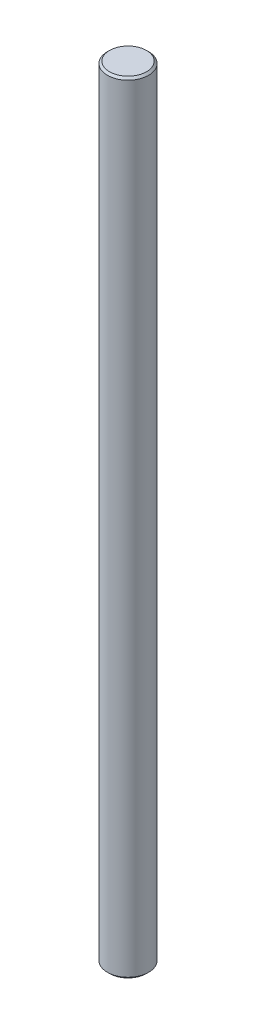
ISO-10303-21;
HEADER;
FILE_DESCRIPTION(('STEP AP214'),'2;1');
FILE_NAME('part.step','',(''),(''),'','','');
FILE_SCHEMA(('AUTOMOTIVE_DESIGN { 1 0 10303 214 1 1 1 1 }'));
ENDSEC;
DATA;
#1=APPLICATION_CONTEXT('core data for automotive mechanical design processes');
#2=APPLICATION_PROTOCOL_DEFINITION('international standard','automotive_design',2000,#1);
#3=PRODUCT_CONTEXT('',#1,'mechanical');
#4=PRODUCT('Part','Part','',(#3));
#5=PRODUCT_RELATED_PRODUCT_CATEGORY('part','',(#4));
#6=PRODUCT_DEFINITION_FORMATION('','',#4);
#7=PRODUCT_DEFINITION_CONTEXT('part definition',#1,'design');
#8=PRODUCT_DEFINITION('design','',#6,#7);
#9=PRODUCT_DEFINITION_SHAPE('','',#8);
#10=(LENGTH_UNIT() NAMED_UNIT(*) SI_UNIT(.MILLI.,.METRE.));
#11=(NAMED_UNIT(*) PLANE_ANGLE_UNIT() SI_UNIT($,.RADIAN.));
#12=(NAMED_UNIT(*) SI_UNIT($,.STERADIAN.) SOLID_ANGLE_UNIT());
#13=UNCERTAINTY_MEASURE_WITH_UNIT(LENGTH_MEASURE(1.E-05),#10,'distance_accuracy_value','');
#14=(GEOMETRIC_REPRESENTATION_CONTEXT(3) GLOBAL_UNCERTAINTY_ASSIGNED_CONTEXT((#13)) GLOBAL_UNIT_ASSIGNED_CONTEXT((#10,
#11,#12)) REPRESENTATION_CONTEXT('',''));
#15=CARTESIAN_POINT('',(0.,0.,0.));
#16=DIRECTION('',(0.,0.,1.));
#17=DIRECTION('',(1.,0.,0.));
#18=AXIS2_PLACEMENT_3D('',#15,#16,#17);
#19=CARTESIAN_POINT('',(-2.044407817928,12.512134028806,4.935145607862));
#20=DIRECTION('',(0.,-1.,0.));
#21=DIRECTION('',(0.,0.,-1.));
#22=AXIS2_PLACEMENT_3D('',#19,#20,#21);
#23=CONICAL_SURFACE('',#22,0.999999999999994,0.785398163397442);
#24=CARTESIAN_POINT('',(-2.044407817928,12.612134028806,4.935145607862));
#25=DIRECTION('',(0.,-1.,0.));
#26=DIRECTION('',(0.,0.,-1.));
#27=AXIS2_PLACEMENT_3D('',#24,#25,#26);
#28=CIRCLE('',#27,0.9);
#29=CARTESIAN_POINT('',(-2.044407817928,12.612134028806,4.035145607862));
#30=VERTEX_POINT('',#29);
#31=EDGE_CURVE('E47',#30,#30,#28,.T.);
#32=ORIENTED_EDGE('',*,*,#31,.T.);
#33=EDGE_LOOP('',(#32));
#34=FACE_BOUND('',#33,.T.);
#35=CARTESIAN_POINT('',(-2.044407817928,12.512134028806,4.935145607862));
#36=DIRECTION('',(0.,-1.,0.));
#37=DIRECTION('',(0.,0.,-1.));
#38=AXIS2_PLACEMENT_3D('',#35,#36,#37);
#39=CIRCLE('',#38,0.999999999999994);
#40=CARTESIAN_POINT('',(-2.044407817928,12.512134028806,3.935145607862));
#41=VERTEX_POINT('',#40);
#42=EDGE_CURVE('E10',#41,#41,#39,.T.);
#43=ORIENTED_EDGE('',*,*,#42,.F.);
#44=EDGE_LOOP('',(#43));
#45=FACE_BOUND('',#44,.T.);
#46=ADVANCED_FACE('F33',(#34,#45),#23,.T.);
#47=CARTESIAN_POINT('',(-2.044407817928,12.612134028806,4.935145607862));
#48=DIRECTION('',(0.,-1.,0.));
#49=DIRECTION('',(0.,0.,-1.));
#50=AXIS2_PLACEMENT_3D('',#47,#48,#49);
#51=CYLINDRICAL_SURFACE('',#50,0.999999999999997);
#52=ORIENTED_EDGE('',*,*,#42,.T.);
#53=EDGE_LOOP('',(#52));
#54=FACE_BOUND('',#53,.T.);
#55=CARTESIAN_POINT('',(-2.044407817928,-25.287865971194,4.935145607862));
#56=DIRECTION('',(0.,-1.,0.));
#57=DIRECTION('',(0.,0.,-1.));
#58=AXIS2_PLACEMENT_3D('',#55,#56,#57);
#59=CIRCLE('',#58,1.);
#60=CARTESIAN_POINT('',(-2.044407817928,-25.287865971194,3.935145607862));
#61=VERTEX_POINT('',#60);
#62=EDGE_CURVE('E39',#61,#61,#59,.T.);
#63=ORIENTED_EDGE('',*,*,#62,.F.);
#64=EDGE_LOOP('',(#63));
#65=FACE_BOUND('',#64,.T.);
#66=ADVANCED_FACE('F66',(#54,#65),#51,.T.);
#67=CARTESIAN_POINT('',(-2.044407817928,-25.387865971194,4.935145607862));
#68=DIRECTION('',(0.,1.,0.));
#69=DIRECTION('',(0.,0.,1.));
#70=AXIS2_PLACEMENT_3D('',#67,#68,#69);
#71=CONICAL_SURFACE('',#70,0.900000000000003,0.78539816339749);
#72=ORIENTED_EDGE('',*,*,#62,.T.);
#73=EDGE_LOOP('',(#72));
#74=FACE_BOUND('',#73,.T.);
#75=CARTESIAN_POINT('',(-2.044407817928,-25.387865971194,4.935145607862));
#76=DIRECTION('',(0.,-1.,0.));
#77=DIRECTION('',(0.,0.,-1.));
#78=AXIS2_PLACEMENT_3D('',#75,#76,#77);
#79=CIRCLE('',#78,0.900000000000003);
#80=CARTESIAN_POINT('',(-2.044407817928,-25.387865971194,4.035145607862));
#81=VERTEX_POINT('',#80);
#82=EDGE_CURVE('E43',#81,#81,#79,.T.);
#83=ORIENTED_EDGE('',*,*,#82,.F.);
#84=EDGE_LOOP('',(#83));
#85=FACE_BOUND('',#84,.T.);
#86=ADVANCED_FACE('F62',(#74,#85),#71,.T.);
#87=CARTESIAN_POINT('',(-2.044407817928,-25.387865971194,4.935145607862));
#88=DIRECTION('',(0.,-1.,0.));
#89=DIRECTION('',(0.,0.,-1.));
#90=AXIS2_PLACEMENT_3D('',#87,#88,#89);
#91=PLANE('',#90);
#92=ORIENTED_EDGE('',*,*,#82,.T.);
#93=EDGE_LOOP('',(#92));
#94=FACE_BOUND('',#93,.T.);
#95=ADVANCED_FACE('F57',(#94),#91,.T.);
#96=CARTESIAN_POINT('',(-1.144407817928,12.612134028806,4.935145607862));
#97=DIRECTION('',(0.,1.,0.));
#98=DIRECTION('',(0.,0.,1.));
#99=AXIS2_PLACEMENT_3D('',#96,#97,#98);
#100=PLANE('',#99);
#101=ORIENTED_EDGE('',*,*,#31,.F.);
#102=EDGE_LOOP('',(#101));
#103=FACE_BOUND('',#102,.T.);
#104=ADVANCED_FACE('F55',(#103),#100,.T.);
#105=CLOSED_SHELL('',(#46,#66,#86,#95,#104));
#106=MANIFOLD_SOLID_BREP('B2',#105);
#107=ADVANCED_BREP_SHAPE_REPRESENTATION('',(#18,#106),#14);
#108=SHAPE_DEFINITION_REPRESENTATION(#9,#107);
ENDSEC;
END-ISO-10303-21;
